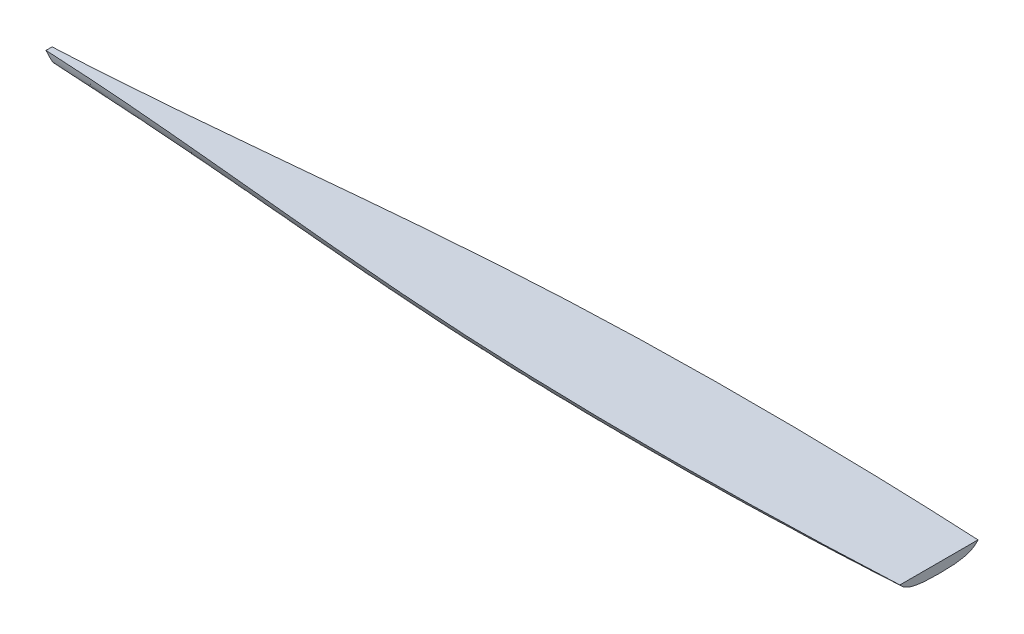
ISO-10303-21;
HEADER;
FILE_DESCRIPTION(('STEP AP214'),'2;1');
FILE_NAME('part.step','',(''),(''),'','','');
FILE_SCHEMA(('AUTOMOTIVE_DESIGN { 1 0 10303 214 1 1 1 1 }'));
ENDSEC;
DATA;
#1=APPLICATION_CONTEXT('core data for automotive mechanical design processes');
#2=APPLICATION_PROTOCOL_DEFINITION('international standard','automotive_design',2000,#1);
#3=PRODUCT_CONTEXT('',#1,'mechanical');
#4=PRODUCT('Part','Part','',(#3));
#5=PRODUCT_RELATED_PRODUCT_CATEGORY('part','',(#4));
#6=PRODUCT_DEFINITION_FORMATION('','',#4);
#7=PRODUCT_DEFINITION_CONTEXT('part definition',#1,'design');
#8=PRODUCT_DEFINITION('design','',#6,#7);
#9=PRODUCT_DEFINITION_SHAPE('','',#8);
#10=(LENGTH_UNIT() NAMED_UNIT(*) SI_UNIT(.MILLI.,.METRE.));
#11=(NAMED_UNIT(*) PLANE_ANGLE_UNIT() SI_UNIT($,.RADIAN.));
#12=(NAMED_UNIT(*) SI_UNIT($,.STERADIAN.) SOLID_ANGLE_UNIT());
#13=UNCERTAINTY_MEASURE_WITH_UNIT(LENGTH_MEASURE(1.E-05),#10,'distance_accuracy_value','');
#14=(GEOMETRIC_REPRESENTATION_CONTEXT(3) GLOBAL_UNCERTAINTY_ASSIGNED_CONTEXT((#13)) GLOBAL_UNIT_ASSIGNED_CONTEXT((#10,
#11,#12)) REPRESENTATION_CONTEXT('',''));
#15=CARTESIAN_POINT('',(0.,0.,0.));
#16=DIRECTION('',(0.,0.,1.));
#17=DIRECTION('',(1.,0.,0.));
#18=AXIS2_PLACEMENT_3D('',#15,#16,#17);
#19=CARTESIAN_POINT('',(0.,-0.100751445753044,0.));
#20=DIRECTION('',(0.,1.,0.));
#21=DIRECTION('',(-1.,0.,0.));
#22=AXIS2_PLACEMENT_3D('',#19,#20,#21);
#23=PLANE('',#22);
#24=DIRECTION('',(0.,0.,1.));
#25=VECTOR('',#24,1.);
#26=CARTESIAN_POINT('',(553.780953203146,-0.100751445753028,55.5625006612436));
#27=LINE('',#26,#25);
#28=CARTESIAN_POINT('',(553.780953203146,-0.100749882933223,-50.4725787140063));
#29=VERTEX_POINT('',#28);
#30=CARTESIAN_POINT('',(553.780953203146,-0.100749882933215,50.4725800364935));
#31=VERTEX_POINT('',#30);
#32=EDGE_CURVE('E84',#29,#31,#27,.T.);
#33=ORIENTED_EDGE('',*,*,#32,.F.);
#34=CARTESIAN_POINT('',(-596.551395221193,-0.100751440876937,-3.93452542387069));
#35=CARTESIAN_POINT('',(-591.026986441482,-0.100751444001736,-4.20030585205301));
#36=CARTESIAN_POINT('',(-585.503302298138,-0.100751445283742,-4.48097007238777));
#37=CARTESIAN_POINT('',(-574.457464285636,-0.100751446222377,-5.070603533796));
#38=CARTESIAN_POINT('',(-568.935310410869,-0.100751445879012,-5.37957266968873));
#39=CARTESIAN_POINT('',(-557.89272684903,-0.100751445627111,-6.02434640537681));
#40=CARTESIAN_POINT('',(-552.372297118171,-0.100751445718563,-6.36015025659977));
#41=CARTESIAN_POINT('',(-541.333032309038,-0.100751445787555,-7.05702746439727));
#42=CARTESIAN_POINT('',(-535.814197232317,-0.100751445765094,-7.41810084551203));
#43=CARTESIAN_POINT('',(-519.262648386861,-0.100751445728993,-8.53662199437139));
#44=CARTESIAN_POINT('',(-508.232319122091,-0.10075144574661,-9.32952243972863));
#45=CARTESIAN_POINT('',(-486.177746301788,-0.100751445759506,-10.9962640758493));
#46=CARTESIAN_POINT('',(-475.153502792806,-0.100751445754785,-11.8701058773632));
#47=CARTESIAN_POINT('',(-453.111757483439,-0.100751445751329,-13.6845052935154));
#48=CARTESIAN_POINT('',(-442.094255072815,-0.100751445752593,-14.6250555271237));
#49=CARTESIAN_POINT('',(-420.063902790547,-0.100751445753519,-16.5586577860871));
#50=CARTESIAN_POINT('',(-409.051052910444,-0.100751445753179,-17.5517097155681));
#51=CARTESIAN_POINT('',(-387.027674695279,-0.100751445752931,-19.5761535005366));
#52=CARTESIAN_POINT('',(-376.017146747781,-0.100751445753022,-20.6075495528666));
#53=CARTESIAN_POINT('',(-353.998389163077,-0.100751445753087,-22.6944897730277));
#54=CARTESIAN_POINT('',(-342.990159526039,-0.100751445753061,-23.7500339426162));
#55=CARTESIAN_POINT('',(-320.974119703534,-0.100751445753042,-25.8715518478386));
#56=CARTESIAN_POINT('',(-309.966309571371,-0.10075144575305,-26.9375261342587));
#57=CARTESIAN_POINT('',(-287.950394713984,-0.100751445753055,-29.0664812625718));
#58=CARTESIAN_POINT('',(-276.942289988662,-0.100751445753052,-30.1294621034635));
#59=CARTESIAN_POINT('',(-254.92448488346,-0.10075144575305,-32.2395509966809));
#60=CARTESIAN_POINT('',(-243.914784494085,-0.10075144575305,-33.2866589502846));
#61=CARTESIAN_POINT('',(-221.892726030774,-0.10075144575305,-35.3526416030744));
#62=CARTESIAN_POINT('',(-210.88036795784,-0.10075144575305,-36.3715163128762));
#63=CARTESIAN_POINT('',(-192.524644625063,-0.100751445753049,-38.0362066593729));
#64=CARTESIAN_POINT('',(-185.182287989331,-0.100751445753049,-38.6931327615621));
#65=CARTESIAN_POINT('',(-170.495712502697,-0.100751445753049,-39.9858957725509));
#66=CARTESIAN_POINT('',(-163.151493651189,-0.100751445753048,-40.6217326744842));
#67=CARTESIAN_POINT('',(-148.460980106989,-0.100751445753048,-41.869107956243));
#68=CARTESIAN_POINT('',(-141.114685411706,-0.100751445753048,-42.4806463055967));
#69=CARTESIAN_POINT('',(-126.419946725623,-0.100751445753047,-43.6763398512473));
#70=CARTESIAN_POINT('',(-119.071502759791,-0.100751445753047,-44.2604953538479));
#71=CARTESIAN_POINT('',(-104.372269648945,-0.100751445753047,-45.3984851608881));
#72=CARTESIAN_POINT('',(-97.021480505741,-0.100751445753046,-45.9523194886809));
#73=CARTESIAN_POINT('',(-82.3174991748319,-0.100751445753046,-47.0268557895541));
#74=CARTESIAN_POINT('',(-74.9643069950778,-0.100751445753046,-47.5475578711696));
#75=CARTESIAN_POINT('',(-62.0912859373432,-0.100751445753045,-48.4276535476638));
#76=CARTESIAN_POINT('',(-56.5719911281332,-0.100751445753045,-48.7948679585466));
#77=CARTESIAN_POINT('',(-45.532032538561,-0.100751445753045,-49.5080642598896));
#78=CARTESIAN_POINT('',(-40.0113687593734,-0.100751445753045,-49.8540461685027));
#79=CARTESIAN_POINT('',(-28.9686422159132,-0.100751445753044,-50.5237504768102));
#80=CARTESIAN_POINT('',(-23.4465794400359,-0.100751445753044,-50.8474726853575));
#81=CARTESIAN_POINT('',(-12.401138252852,-0.100751445753044,-51.4716599887258));
#82=CARTESIAN_POINT('',(-6.87775984130079,-0.100751445753044,-51.7721250792187));
#83=CARTESIAN_POINT('',(4.17020261037983,-0.100751445753044,-52.3503689760028));
#84=CARTESIAN_POINT('',(9.69478665463904,-0.100751445753043,-52.6281477033196));
#85=CARTESIAN_POINT('',(20.7450228946548,-0.100751445753043,-53.1615734322049));
#86=CARTESIAN_POINT('',(26.2706750905335,-0.100751445753043,-53.4172204312403));
#87=CARTESIAN_POINT('',(37.3229191725076,-0.100751445753043,-53.9069115222467));
#88=CARTESIAN_POINT('',(42.8495110555806,-0.100751445753042,-54.1409556824306));
#89=CARTESIAN_POINT('',(53.9035441776339,-0.100751445753042,-54.5879488295096));
#90=CARTESIAN_POINT('',(59.4309854165587,-0.100751445753042,-54.8008978177799));
#91=CARTESIAN_POINT('',(76.0172454052,-0.100751445753041,-55.4089415984302));
#92=CARTESIAN_POINT('',(87.0772119824959,-0.100751445753041,-55.7731101605416));
#93=CARTESIAN_POINT('',(109.199449679466,-0.100751445753041,-56.4226667603247));
#94=CARTESIAN_POINT('',(120.261720801786,-0.10075144575304,-56.70805470708));
#95=CARTESIAN_POINT('',(142.388007949701,-0.10075144575304,-57.2034418459972));
#96=CARTESIAN_POINT('',(153.452023984381,-0.100751445753039,-57.4134406317527));
#97=CARTESIAN_POINT('',(175.581218023315,-0.100751445753039,-57.7611877497625));
#98=CARTESIAN_POINT('',(186.64639603156,-0.100751445753038,-57.898935825142));
#99=CARTESIAN_POINT('',(212.556683913485,-0.100751445753038,-58.1403096394913));
#100=CARTESIAN_POINT('',(227.402057599018,-0.100751445753037,-58.2162134620921));
#101=CARTESIAN_POINT('',(257.092941281324,-0.100751445753036,-58.2496510546995));
#102=CARTESIAN_POINT('',(271.938451278334,-0.100751445753036,-58.2071845494132));
#103=CARTESIAN_POINT('',(301.628834000713,-0.100751445753035,-58.0094934539997));
#104=CARTESIAN_POINT('',(316.473706720627,-0.100751445753035,-57.8542680393072));
#105=CARTESIAN_POINT('',(338.739870222323,-0.100751445753034,-57.5402755558708));
#106=CARTESIAN_POINT('',(346.161757863013,-0.100751445753034,-57.4220851528873));
#107=CARTESIAN_POINT('',(361.005060185547,-0.100751445753033,-57.1590764292771));
#108=CARTESIAN_POINT('',(368.426474867701,-0.100751445753033,-57.0142581263652));
#109=CARTESIAN_POINT('',(383.265018931424,-0.100751445753033,-56.6984000937323));
#110=CARTESIAN_POINT('',(390.682148594585,-0.100751445753033,-56.5273735586687));
#111=CARTESIAN_POINT('',(405.515759533324,-0.100751445753032,-56.1592143970368));
#112=CARTESIAN_POINT('',(412.932240808961,-0.100751445753032,-55.9620817728886));
#113=CARTESIAN_POINT('',(427.76440372492,-0.100751445753031,-55.5416805783389));
#114=CARTESIAN_POINT('',(435.18008537112,-0.100751445753031,-55.3184122153171));
#115=CARTESIAN_POINT('',(450.010608973035,-0.100751445753031,-54.8454388345068));
#116=CARTESIAN_POINT('',(457.425450928448,-0.10075144575303,-54.5957338072575));
#117=CARTESIAN_POINT('',(472.254031153465,-0.10075144575303,-54.0692288059618));
#118=CARTESIAN_POINT('',(479.667769441467,-0.100751445753031,-53.792429350308));
#119=CARTESIAN_POINT('',(494.494134943463,-0.100751445753029,-53.2105850722551));
#120=CARTESIAN_POINT('',(501.906762158514,-0.100751445753026,-52.9055402769134));
#121=CARTESIAN_POINT('',(513.02465477028,-0.100751445753031,-52.4253946546348));
#122=CARTESIAN_POINT('',(516.730410295015,-0.100751445753034,-52.2615846480065));
#123=CARTESIAN_POINT('',(524.141565729447,-0.100751445753024,-51.9261089609627));
#124=CARTESIAN_POINT('',(527.846965639213,-0.100751445753011,-51.7544432820779));
#125=CARTESIAN_POINT('',(535.257385950423,-0.100751445753046,-51.4028774686021));
#126=CARTESIAN_POINT('',(538.962406350733,-0.100751445753093,-51.2229773100876));
#127=CARTESIAN_POINT('',(546.372015290313,-0.100751445752963,-50.8544487297704));
#128=CARTESIAN_POINT('',(550.076603829296,-0.100751445752786,-50.6658203022151));
#129=CARTESIAN_POINT('',(553.780953203146,-0.100751445752354,-50.4725807229853));
#130=B_SPLINE_CURVE_WITH_KNOTS('',3,(#34,#35,#36,#37,#38,#39,#40,#41,#42,#43,#44,#45,#46,#47,
#48,#49,#50,#51,#52,#53,#54,#55,#56,#57,#58,#59,#60,#61,#62,#63,#64,#65,#66,#67,#68,#69,#70,#71,
#72,#73,#74,#75,#76,#77,#78,#79,#80,#81,#82,#83,#84,#85,#86,#87,#88,#89,#90,#91,#92,#93,#94,#95,
#96,#97,#98,#99,#100,#101,#102,#103,#104,#105,#106,#107,#108,#109,#110,#111,#112,#113,#114,#115,
#116,#117,#118,#119,#120,#121,#122,#123,#124,#125,#126,#127,#128,#129),.UNSPECIFIED.,.F.,.F.,(4,
2,2,2,2,2,2,2,2,2,2,2,2,2,2,2,2,2,2,2,2,2,2,2,2,2,2,2,2,2,2,2,2,2,2,2,2,2,2,2,2,2,2,2,2,2,2,4),
(0.,16.5923626426887,33.184663630854,49.7765019271068,66.3683563365536,99.5443363807423,
132.720566777754,165.893132062643,199.06563677267,232.241783032548,265.417931706787,
298.595841881657,331.77376315188,364.951890688817,398.130005750694,420.245038412381,
442.360078274161,464.475145868652,486.589966025507,508.704769149442,530.819499825679,
547.413954443446,564.008394873397,580.602977784238,597.197563783279,613.792207547948,
630.386853211979,646.981446475159,663.576038656595,696.77359627935,729.971192213518,
763.168967105975,796.366860026481,840.903036910463,885.439317371962,929.975923514518,
952.244371034401,974.512803739751,996.770061909348,1019.0273180157,1041.28439752903,
1063.54148500745,1085.79814672836,1108.05478712885,1119.18290323883,1130.31101718049,
1141.43916345454,1152.56731706287),.UNSPECIFIED.);
#131=CARTESIAN_POINT('',(-596.55139529419,-0.10075130956628,-3.93452682417129));
#132=VERTEX_POINT('',#131);
#133=EDGE_CURVE('E88',#132,#29,#130,.T.);
#134=ORIENTED_EDGE('',*,*,#133,.F.);
#135=DIRECTION('',(0.,0.,-1.));
#136=VECTOR('',#135,1.);
#137=CARTESIAN_POINT('',(-596.551395215563,-0.100751445753063,5.95312566124441));
#138=LINE('',#137,#136);
#139=CARTESIAN_POINT('',(-596.55139529419,-0.100751309566186,3.93452814665851));
#140=VERTEX_POINT('',#139);
#141=EDGE_CURVE('E85',#140,#132,#138,.T.);
#142=ORIENTED_EDGE('',*,*,#141,.F.);
#143=CARTESIAN_POINT('',(553.780953203146,-0.100751447117983,50.4725820433484));
#144=CARTESIAN_POINT('',(551.865367801599,-0.100751446256089,50.5725180783247));
#145=CARTESIAN_POINT('',(549.949717963459,-0.100751445890812,50.671213596536));
#146=CARTESIAN_POINT('',(546.118295301254,-0.100751445615244,50.8662016485795));
#147=CARTESIAN_POINT('',(544.202522477146,-0.100751445704952,50.9624941815644));
#148=CARTESIAN_POINT('',(538.454976668348,-0.100751445849178,51.2478869393229));
#149=CARTESIAN_POINT('',(534.623030055735,-0.100751445778793,51.4334995253199));
#150=CARTESIAN_POINT('',(526.958722383097,-0.100751445727264,51.7959434890552));
#151=CARTESIAN_POINT('',(523.126361323072,-0.10075144574612,51.9727748667807));
#152=CARTESIAN_POINT('',(515.461279667178,-0.100751445759937,52.3180760811833));
#153=CARTESIAN_POINT('',(511.628559072981,-0.100751445754898,52.4865459549756));
#154=CARTESIAN_POINT('',(503.962769939389,-0.10075144575116,52.8154655659478));
#155=CARTESIAN_POINT('',(500.129701399607,-0.100751445752462,52.9759152941311));
#156=CARTESIAN_POINT('',(491.185106593094,-0.100751445753786,53.3412814735624));
#157=CARTESIAN_POINT('',(486.073457008137,-0.100751445753237,53.5431859208654));
#158=CARTESIAN_POINT('',(475.849650180751,-0.100751445752823,53.9337245857599));
#159=CARTESIAN_POINT('',(470.737492938059,-0.100751445752958,54.1223587964094));
#160=CARTESIAN_POINT('',(455.400282460051,-0.100751445753175,54.6689237339102));
#161=CARTESIAN_POINT('',(445.174533839506,-0.10075144575307,55.0075150019046));
#162=CARTESIAN_POINT('',(424.72151728882,-0.100751445752993,55.6347409519789));
#163=CARTESIAN_POINT('',(414.494249359543,-0.100751445753021,55.9233756623821));
#164=CARTESIAN_POINT('',(394.037343709885,-0.100751445753043,56.4510789169399));
#165=CARTESIAN_POINT('',(383.807705853123,-0.100751445753036,56.6901421790284));
#166=CARTESIAN_POINT('',(363.347380421141,-0.10075144575303,57.1182607091595));
#167=CARTESIAN_POINT('',(353.116692845813,-0.100751445753032,57.3073159719852));
#168=CARTESIAN_POINT('',(332.654408784113,-0.100751445753036,57.6344671754329));
#169=CARTESIAN_POINT('',(322.422812289987,-0.100751445753037,57.7725626289184));
#170=CARTESIAN_POINT('',(296.831533946059,-0.100751445753038,58.0525921787504));
#171=CARTESIAN_POINT('',(281.471478884254,-0.100751445753036,58.1617701009789));
#172=CARTESIAN_POINT('',(250.750792727684,-0.100751445753036,58.2567462765992));
#173=CARTESIAN_POINT('',(235.390161628182,-0.100751445753037,58.2425430280051));
#174=CARTESIAN_POINT('',(204.669466424012,-0.100751445753038,58.0840948579493));
#175=CARTESIAN_POINT('',(189.30940232312,-0.100751445753038,57.9398491872406));
#176=CARTESIAN_POINT('',(158.590959890259,-0.100751445753039,57.5138232951473));
#177=CARTESIAN_POINT('',(143.232581578818,-0.10075144575304,57.2320415523869));
#178=CARTESIAN_POINT('',(120.19911009395,-0.10075144575304,56.69997485257));
#179=CARTESIAN_POINT('',(112.522723095048,-0.10075144575304,56.5044115295965));
#180=CARTESIAN_POINT('',(97.1709924492131,-0.100751445753041,56.0756812896961));
#181=CARTESIAN_POINT('',(89.495648802171,-0.100751445753041,55.8425143767012));
#182=CARTESIAN_POINT('',(74.146253310194,-0.100751445753042,55.3373888837126));
#183=CARTESIAN_POINT('',(66.4722014625867,-0.100751445753042,55.0654303849785));
#184=CARTESIAN_POINT('',(51.1256178855279,-0.100751445753042,54.4814597212883));
#185=CARTESIAN_POINT('',(43.4530861565953,-0.100751445753042,54.1694475426816));
#186=CARTESIAN_POINT('',(28.1099814502312,-0.100751445753043,53.5040456443998));
#187=CARTESIAN_POINT('',(20.439408432914,-0.100751445753043,53.1506568481375));
#188=CARTESIAN_POINT('',(8.93512896749031,-0.100751445753043,52.5884686769341));
#189=CARTESIAN_POINT('',(5.1006323545617,-0.100751445753044,52.39572178307));
#190=CARTESIAN_POINT('',(-2.56779952630319,-0.100751445753044,51.9993495219662));
#191=CARTESIAN_POINT('',(-6.40173479428531,-0.100751445753044,51.7957241556149));
#192=CARTESIAN_POINT('',(-14.0689070572772,-0.100751445753044,51.3773705829918));
#193=CARTESIAN_POINT('',(-17.9021440668496,-0.100751445753044,51.1626426435752));
#194=CARTESIAN_POINT('',(-25.5679780404939,-0.100751445753044,50.7220509716331));
#195=CARTESIAN_POINT('',(-29.4005750045372,-0.100751445753044,50.4961872386118));
#196=CARTESIAN_POINT('',(-37.0651245925135,-0.100751445753045,50.0337098198147));
#197=CARTESIAN_POINT('',(-40.8970772156897,-0.100751445753045,49.7970961215037));
#198=CARTESIAN_POINT('',(-48.5603236103653,-0.100751445753045,49.3134464328087));
#199=CARTESIAN_POINT('',(-52.3916173818574,-0.100751445753044,49.0664104423121));
#200=CARTESIAN_POINT('',(-63.7369537534638,-0.100751445753044,48.3199077551176));
#201=CARTESIAN_POINT('',(-71.2500570629486,-0.100751445753045,47.806105649681));
#202=CARTESIAN_POINT('',(-86.2737270336239,-0.100751445753047,46.7425269425514));
#203=CARTESIAN_POINT('',(-93.784293688463,-0.100751445753046,46.1927502514439));
#204=CARTESIAN_POINT('',(-108.802935444031,-0.100751445753047,45.0601487878065));
#205=CARTESIAN_POINT('',(-116.311010543435,-0.100751445753047,44.4773239977344));
#206=CARTESIAN_POINT('',(-131.324876976943,-0.100751445753047,43.281690996061));
#207=CARTESIAN_POINT('',(-138.8306682767,-0.100751445753048,42.6688823539599));
#208=CARTESIAN_POINT('',(-153.840006093506,-0.100751445753048,41.4165087692665));
#209=CARTESIAN_POINT('',(-161.343552613071,-0.100751445753048,40.7769438567745));
#210=CARTESIAN_POINT('',(-176.34860878234,-0.100751445753049,39.4744221547979));
#211=CARTESIAN_POINT('',(-183.850118432665,-0.100751445753049,38.8114653724592));
#212=CARTESIAN_POINT('',(-202.60337004184,-0.100751445753049,37.1290422181432));
#213=CARTESIAN_POINT('',(-213.853994435213,-0.10075144575305,36.097130202494));
#214=CARTESIAN_POINT('',(-236.352210583006,-0.10075144575305,34.0008837026564));
#215=CARTESIAN_POINT('',(-247.599802336371,-0.100751445753051,32.9365492071997));
#216=CARTESIAN_POINT('',(-270.093047337007,-0.100751445753051,30.788499717067));
#217=CARTESIAN_POINT('',(-281.338700597516,-0.100751445753051,29.704784860494));
#218=CARTESIAN_POINT('',(-303.829444362297,-0.100751445753053,27.5315923928462));
#219=CARTESIAN_POINT('',(-315.074534866733,-0.100751445753056,26.4421147834511));
#220=CARTESIAN_POINT('',(-337.561964898998,-0.100751445753056,24.2719039085056));
#221=CARTESIAN_POINT('',(-348.804304168735,-0.100751445753054,23.1911679802133));
#222=CARTESIAN_POINT('',(-371.291179400106,-0.100751445753054,21.0527009703042));
#223=CARTESIAN_POINT('',(-382.535715361407,-0.100751445753058,19.9949698852017));
#224=CARTESIAN_POINT('',(-405.027055834903,-0.100751445753052,17.9175969643962));
#225=CARTESIAN_POINT('',(-416.273859954357,-0.100751445753043,16.8979508948829));
#226=CARTESIAN_POINT('',(-438.772214474882,-0.100751445753068,14.9118130765846));
#227=CARTESIAN_POINT('',(-450.023764885271,-0.100751445753102,13.9453214326473));
#228=CARTESIAN_POINT('',(-468.783989297727,-0.100751445753026,12.3912524295702));
#229=CARTESIAN_POINT('',(-476.291089582331,-0.100751445752961,11.7846895586198));
#230=CARTESIAN_POINT('',(-491.308020049472,-0.100751445753154,10.606460720745));
#231=CARTESIAN_POINT('',(-498.817850226152,-0.100751445753413,10.0347946793706));
#232=CARTESIAN_POINT('',(-513.840349347893,-0.100751445752704,8.9307666819258));
#233=CARTESIAN_POINT('',(-521.353018270893,-0.100751445751736,8.39840442647625));
#234=CARTESIAN_POINT('',(-536.383119194736,-0.100751445754382,7.37713936926576));
#235=CARTESIAN_POINT('',(-543.900551904753,-0.100751445757998,6.88824698213883));
#236=CARTESIAN_POINT('',(-558.938451749861,-0.100751445748121,5.95817167181086));
#237=CARTESIAN_POINT('',(-566.458918911773,-0.100751445734629,5.51698918003007));
#238=CARTESIAN_POINT('',(-577.741869081478,-0.100751445762276,4.8938913596911));
#239=CARTESIAN_POINT('',(-581.503290572263,-0.100751445779472,4.69263501695441));
#240=CARTESIAN_POINT('',(-589.026827791943,-0.100751445726648,4.3034634330129));
#241=CARTESIAN_POINT('',(-592.788943521642,-0.100751445656627,4.1155482073831));
#242=CARTESIAN_POINT('',(-596.551395227938,-0.100751445491407,3.9345267445076));
#243=B_SPLINE_CURVE_WITH_KNOTS('',3,(#143,#144,#145,#146,#147,#148,#149,#150,#151,#152,#153,
#154,#155,#156,#157,#158,#159,#160,#161,#162,#163,#164,#165,#166,#167,#168,#169,#170,#171,#172,
#173,#174,#175,#176,#177,#178,#179,#180,#181,#182,#183,#184,#185,#186,#187,#188,#189,#190,#191,
#192,#193,#194,#195,#196,#197,#198,#199,#200,#201,#202,#203,#204,#205,#206,#207,#208,#209,#210,
#211,#212,#213,#214,#215,#216,#217,#218,#219,#220,#221,#222,#223,#224,#225,#226,#227,#228,#229,
#230,#231,#232,#233,#234,#235,#236,#237,#238,#239,#240,#241,#242),.UNSPECIFIED.,.F.,.F.,(4,2,2,
2,2,2,2,2,2,2,2,2,2,2,2,2,2,2,2,2,2,2,2,2,2,2,2,2,2,2,2,2,2,2,2,2,2,2,2,2,2,2,2,2,2,2,2,2,2,4),
(0.,5.75457047516003,11.5091429796212,23.0184493321825,34.527755701598,46.0370109786053,
57.5462791657983,72.8931662508356,88.240061364038,118.933981790681,149.627884815157,
180.325056737706,211.022231862644,241.71970042125,287.800533376194,333.881927298841,
379.963586723854,426.045755899612,449.082313277404,472.11886824646,495.155374959906,
518.191889524279,541.227890074681,552.745891158344,564.263891301248,575.781614732539,
587.299338676687,598.81707605168,610.334813551178,632.926665619109,655.518573840969,
678.110494055005,700.702738732821,723.294957995395,745.887170356351,779.780643688665,
813.67412880068,847.567372486517,881.460606293422,915.343094828043,949.225578228536,
983.104283724092,1016.9830560434,1039.5776831286,1062.17226200807,1084.76666876561,
1107.36647425053,1129.96648407877,1141.26686860588,1152.56726632536),.UNSPECIFIED.);
#244=EDGE_CURVE('E81',#31,#140,#243,.T.);
#245=ORIENTED_EDGE('',*,*,#244,.F.);
#246=EDGE_LOOP('',(#33,#134,#142,#245));
#247=FACE_BOUND('',#246,.T.);
#248=ADVANCED_FACE('F39',(#247),#23,.T.);
#249=CARTESIAN_POINT('',(553.780953203146,11.0117485542469,55.5625006612436));
#250=DIRECTION('',(1.,0.,0.));
#251=DIRECTION('',(0.,0.,-1.));
#252=AXIS2_PLACEMENT_3D('',#249,#250,#251);
#253=PLANE('',#252);
#254=CARTESIAN_POINT('',(553.780953203146,-12.8007514457532,6.61243597210876E-07));
#255=CARTESIAN_POINT('',(553.780953203146,-12.8007514457532,-74.0833326720897));
#256=CARTESIAN_POINT('',(553.780953203146,8.36591522091353,-55.5624993387564));
#257=CARTESIAN_POINT('',(553.780953203146,114.199248554247,-55.5624993387564));
#258=B_SPLINE_CURVE_WITH_KNOTS('',3,(#254,#255,#256,#257),.UNSPECIFIED.,.F.,.F.,(4,4),(0.,1.),.UNSPECIFIED.);
#259=CARTESIAN_POINT('',(553.780953203146,-12.8007514457532,6.61243597210876E-07));
#260=VERTEX_POINT('',#259);
#261=EDGE_CURVE('E66',#260,#29,#258,.T.);
#262=ORIENTED_EDGE('',*,*,#261,.T.);
#263=ORIENTED_EDGE('',*,*,#32,.T.);
#264=CARTESIAN_POINT('',(553.780953203146,-12.8007514457532,6.61243597210876E-07));
#265=CARTESIAN_POINT('',(553.780953203146,-12.8007514457532,74.0833339945769));
#266=CARTESIAN_POINT('',(553.780953203146,8.36591522091353,55.5625006612436));
#267=CARTESIAN_POINT('',(553.780953203146,114.199248554247,55.5625006612436));
#268=B_SPLINE_CURVE_WITH_KNOTS('',3,(#264,#265,#266,#267),.UNSPECIFIED.,.F.,.F.,(4,4),(0.,1.),.UNSPECIFIED.);
#269=EDGE_CURVE('E93',#260,#31,#268,.T.);
#270=ORIENTED_EDGE('',*,*,#269,.F.);
#271=EDGE_LOOP('',(#262,#263,#270));
#272=FACE_BOUND('',#271,.T.);
#273=ADVANCED_FACE('F92',(#272),#253,.T.);
#274=CARTESIAN_POINT('',(553.780953203146,-12.8007514457532,6.61243597210876E-07));
#275=CARTESIAN_POINT('',(363.280953203146,-23.3840847790864,6.61243639510374E-07));
#276=CARTESIAN_POINT('',(-47.9138628846482,-33.984010045265,6.61243681876185E-07));
#277=CARTESIAN_POINT('',(-398.719046796854,-23.3840847790864,6.61243639510374E-07));
#278=CARTESIAN_POINT('',(-589.219046796854,-12.8007514457532,6.61243597210876E-07));
#279=CARTESIAN_POINT('',(553.780953203146,-12.8007514457532,-74.0833326720897));
#280=CARTESIAN_POINT('',(363.149270514041,-19.8563070013087,-78.3284004177268));
#281=CARTESIAN_POINT('',(-51.5452336226101,-37.5228491116064,-77.9584209778541));
#282=CARTESIAN_POINT('',(-390.703675687394,-19.8563070013087,-14.8284004177269));
#283=CARTESIAN_POINT('',(-589.219046796854,-12.8007514457532,-5.29166600542307));
#284=CARTESIAN_POINT('',(553.780953203146,8.36591522091353,-55.5624993387564));
#285=CARTESIAN_POINT('',(363.017587824936,4.83813744313578,-64.0526348300307));
#286=CARTESIAN_POINT('',(-40.8609521324241,39.2867906570279,-80.056732606557));
#287=CARTESIAN_POINT('',(-413.678455431684,37.347986589387,-27.010968163364));
#288=CARTESIAN_POINT('',(-620.209197650604,40.8757643671648,-7.9374993387564));
#289=CARTESIAN_POINT('',(553.780953203146,114.199248554247,-55.5624993387564));
#290=CARTESIAN_POINT('',(362.885905135831,114.199248554247,-68.2977025756679));
#291=CARTESIAN_POINT('',(-24.9367782549931,114.199248554247,-73.3539114446648));
#292=CARTESIAN_POINT('',(-447.996417655558,114.199248554247,-36.5477025756679));
#293=CARTESIAN_POINT('',(-662.542530983938,114.199248554247,-7.9374993387564));
#294=B_SPLINE_SURFACE_WITH_KNOTS('',3,3,((#274,#275,#276,#277,#278),(#279,#280,#281,#282,#283),
(#284,#285,#286,#287,#288),(#289,#290,#291,#292,#293)),.UNSPECIFIED.,.F.,.F.,.F.,(4,4),(4,1,4),
(0.,1.),(0.,0.48021814139568,1.),.UNSPECIFIED.);
#295=CARTESIAN_POINT('',(-662.542530983938,114.199248554247,-7.9374993387564));
#296=CARTESIAN_POINT('',(-620.209197650604,40.8757643671648,-7.9374993387564));
#297=CARTESIAN_POINT('',(-589.219046796854,-12.8007514457532,-5.29166600542307));
#298=CARTESIAN_POINT('',(-589.219046796854,-12.8007514457532,6.61243597210876E-07));
#299=B_SPLINE_CURVE_WITH_KNOTS('',3,(#295,#296,#297,#298),.UNSPECIFIED.,.F.,.F.,(4,4),(0.,1.),.UNSPECIFIED.);
#300=CARTESIAN_POINT('',(-589.219046796854,-12.8007514457532,6.61243597210876E-07));
#301=VERTEX_POINT('',#300);
#302=EDGE_CURVE('E51',#132,#301,#299,.T.);
#303=CARTESIAN_POINT('',(553.780953203146,-12.8007514457532,6.61243597210876E-07));
#304=CARTESIAN_POINT('',(363.280953203146,-23.3840847790864,6.61243597210876E-07));
#305=CARTESIAN_POINT('',(-47.9138628846482,-33.984010045265,6.61243597210876E-07));
#306=CARTESIAN_POINT('',(-398.719046796854,-23.3840847790864,6.61243597210876E-07));
#307=CARTESIAN_POINT('',(-589.219046796854,-12.8007514457532,6.61243597210876E-07));
#308=B_SPLINE_CURVE_WITH_KNOTS('',3,(#303,#304,#305,#306,#307),.UNSPECIFIED.,.F.,.F.,(4,1,4),
(0.,0.48021814139568,1.),.UNSPECIFIED.);
#309=EDGE_CURVE('E99',#260,#301,#308,.T.);
#310=ORIENTED_EDGE('',*,*,#302,.F.);
#311=ORIENTED_EDGE('',*,*,#133,.T.);
#312=ORIENTED_EDGE('',*,*,#261,.F.);
#313=ORIENTED_EDGE('',*,*,#309,.T.);
#314=EDGE_LOOP('',(#310,#311,#312,#313));
#315=FACE_BOUND('',#314,.T.);
#316=ADVANCED_FACE('F125',(#315),#294,.F.);
#317=CARTESIAN_POINT('',(553.780953203146,-12.8007514457532,6.61243597210876E-07));
#318=CARTESIAN_POINT('',(363.280953203146,-23.3840847790864,6.61243554911379E-07));
#319=CARTESIAN_POINT('',(-47.9138628846482,-33.984010045265,6.61243512545567E-07));
#320=CARTESIAN_POINT('',(-398.719046796854,-23.3840847790864,6.61243554911379E-07));
#321=CARTESIAN_POINT('',(-589.219046796854,-12.8007514457532,6.61243597210876E-07));
#322=CARTESIAN_POINT('',(553.780953203146,-12.8007514457532,74.0833339945769));
#323=CARTESIAN_POINT('',(363.149270514041,-19.8563070013087,78.328401740214));
#324=CARTESIAN_POINT('',(-51.5452336226101,-37.5228491116064,77.9584223003413));
#325=CARTESIAN_POINT('',(-390.703675687394,-19.8563070013087,14.8284017402141));
#326=CARTESIAN_POINT('',(-589.219046796854,-12.8007514457532,5.29166732791026));
#327=CARTESIAN_POINT('',(553.780953203146,8.36591522091353,55.5625006612436));
#328=CARTESIAN_POINT('',(363.017587824936,4.83813744313578,64.0526361525179));
#329=CARTESIAN_POINT('',(-40.8609521324241,39.2867906570279,80.0567339290442));
#330=CARTESIAN_POINT('',(-413.678455431684,37.347986589387,27.0109694858512));
#331=CARTESIAN_POINT('',(-620.209197650604,40.8757643671648,7.9375006612436));
#332=CARTESIAN_POINT('',(553.780953203146,114.199248554247,55.5625006612436));
#333=CARTESIAN_POINT('',(362.885905135831,114.199248554247,68.2977038981551));
#334=CARTESIAN_POINT('',(-24.9367782549931,114.199248554247,73.353912767152));
#335=CARTESIAN_POINT('',(-447.996417655558,114.199248554247,36.5477038981551));
#336=CARTESIAN_POINT('',(-662.542530983938,114.199248554247,7.9375006612436));
#337=B_SPLINE_SURFACE_WITH_KNOTS('',3,3,((#317,#318,#319,#320,#321),(#322,#323,#324,#325,#326),
(#327,#328,#329,#330,#331),(#332,#333,#334,#335,#336)),.UNSPECIFIED.,.F.,.F.,.F.,(4,4),(4,1,4),
(0.,1.),(0.,0.48021814139568,1.),.UNSPECIFIED.);
#338=CARTESIAN_POINT('',(-662.542530983938,114.199248554247,7.9375006612436));
#339=CARTESIAN_POINT('',(-620.209197650604,40.8757643671648,7.9375006612436));
#340=CARTESIAN_POINT('',(-589.219046796854,-12.8007514457532,5.29166732791026));
#341=CARTESIAN_POINT('',(-589.219046796854,-12.8007514457532,6.61243597210876E-07));
#342=B_SPLINE_CURVE_WITH_KNOTS('',3,(#338,#339,#340,#341),.UNSPECIFIED.,.F.,.F.,(4,4),(0.,1.),.UNSPECIFIED.);
#343=EDGE_CURVE('E11',#140,#301,#342,.T.);
#344=ORIENTED_EDGE('',*,*,#269,.T.);
#345=ORIENTED_EDGE('',*,*,#244,.T.);
#346=ORIENTED_EDGE('',*,*,#343,.T.);
#347=ORIENTED_EDGE('',*,*,#309,.F.);
#348=EDGE_LOOP('',(#344,#345,#346,#347));
#349=FACE_BOUND('',#348,.T.);
#350=ADVANCED_FACE('F98',(#349),#337,.T.);
#351=CARTESIAN_POINT('',(-610.005788890396,23.2029419840911,5.9531256612436));
#352=DIRECTION('',(-0.866025403784437,-0.500000000000003,0.));
#353=DIRECTION('',(0.500000000000003,-0.866025403784437,0.));
#354=AXIS2_PLACEMENT_3D('',#351,#352,#353);
#355=PLANE('',#354);
#356=ORIENTED_EDGE('',*,*,#343,.F.);
#357=ORIENTED_EDGE('',*,*,#141,.T.);
#358=ORIENTED_EDGE('',*,*,#302,.T.);
#359=EDGE_LOOP('',(#356,#357,#358));
#360=FACE_BOUND('',#359,.T.);
#361=ADVANCED_FACE('F41',(#360),#355,.T.);
#362=CLOSED_SHELL('',(#248,#273,#316,#350,#361));
#363=MANIFOLD_SOLID_BREP('B2',#362);
#364=ADVANCED_BREP_SHAPE_REPRESENTATION('',(#18,#363),#14);
#365=SHAPE_DEFINITION_REPRESENTATION(#9,#364);
ENDSEC;
END-ISO-10303-21;
